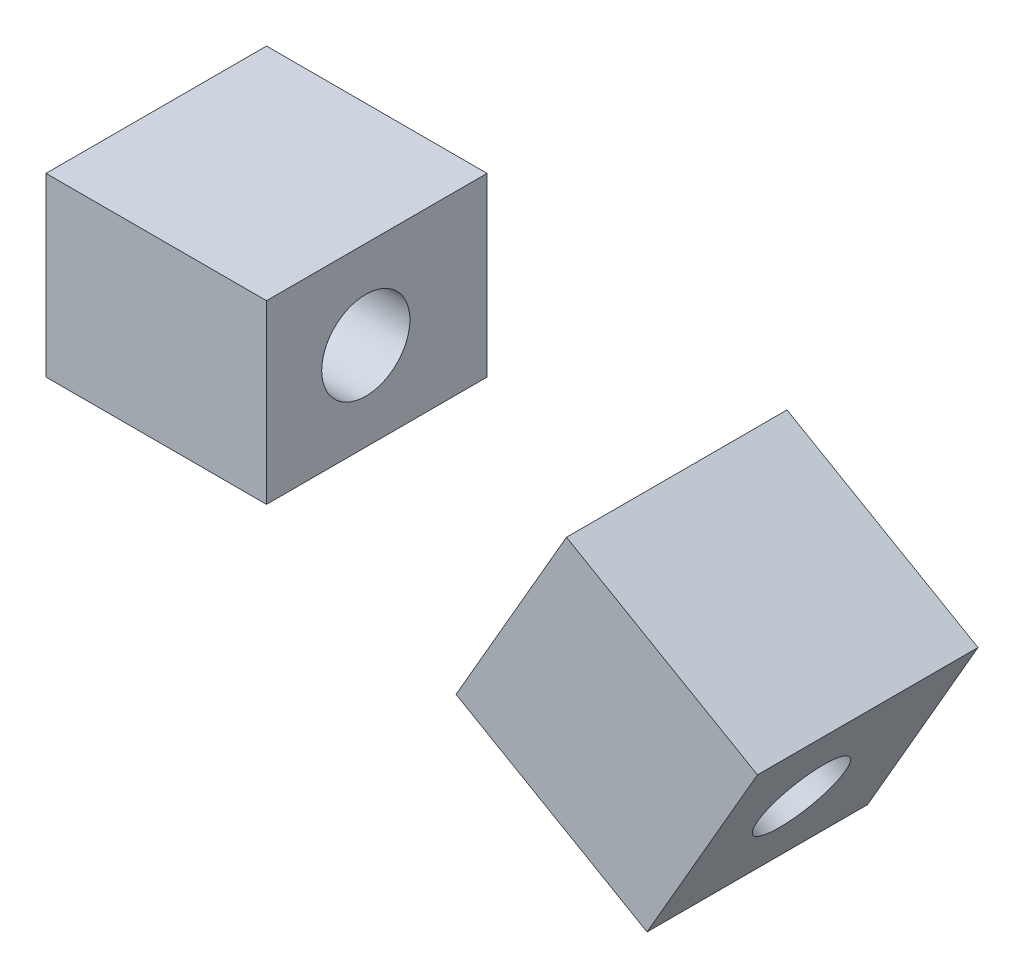
ISO-10303-21;
HEADER;
FILE_DESCRIPTION(('STEP AP214'),'2;1');
FILE_NAME('part.step','',(''),(''),'','','');
FILE_SCHEMA(('AUTOMOTIVE_DESIGN { 1 0 10303 214 1 1 1 1 }'));
ENDSEC;
DATA;
#1=APPLICATION_CONTEXT('core data for automotive mechanical design processes');
#2=APPLICATION_PROTOCOL_DEFINITION('international standard','automotive_design',2000,#1);
#3=PRODUCT_CONTEXT('',#1,'mechanical');
#4=PRODUCT('Part','Part','',(#3));
#5=PRODUCT_RELATED_PRODUCT_CATEGORY('part','',(#4));
#6=PRODUCT_DEFINITION_FORMATION('','',#4);
#7=PRODUCT_DEFINITION_CONTEXT('part definition',#1,'design');
#8=PRODUCT_DEFINITION('design','',#6,#7);
#9=PRODUCT_DEFINITION_SHAPE('','',#8);
#10=(LENGTH_UNIT() NAMED_UNIT(*) SI_UNIT(.MILLI.,.METRE.));
#11=(NAMED_UNIT(*) PLANE_ANGLE_UNIT() SI_UNIT($,.RADIAN.));
#12=(NAMED_UNIT(*) SI_UNIT($,.STERADIAN.) SOLID_ANGLE_UNIT());
#13=UNCERTAINTY_MEASURE_WITH_UNIT(LENGTH_MEASURE(1.E-05),#10,'distance_accuracy_value','');
#14=(GEOMETRIC_REPRESENTATION_CONTEXT(3) GLOBAL_UNCERTAINTY_ASSIGNED_CONTEXT((#13)) GLOBAL_UNIT_ASSIGNED_CONTEXT((#10,
#11,#12)) REPRESENTATION_CONTEXT('',''));
#15=CARTESIAN_POINT('',(0.,0.,0.));
#16=DIRECTION('',(0.,0.,1.));
#17=DIRECTION('',(1.,0.,0.));
#18=AXIS2_PLACEMENT_3D('',#15,#16,#17);
#19=CARTESIAN_POINT('',(-11.8142793956161,-8.00000000000001,20.));
#20=DIRECTION('',(-1.,0.,0.));
#21=DIRECTION('',(0.,0.,1.));
#22=AXIS2_PLACEMENT_3D('',#19,#20,#21);
#23=PLANE('',#22);
#24=CARTESIAN_POINT('',(-11.8142793956161,0.,11.));
#25=DIRECTION('',(-1.,0.,0.));
#26=DIRECTION('',(0.,0.,1.));
#27=AXIS2_PLACEMENT_3D('',#24,#25,#26);
#28=CIRCLE('',#27,4.);
#29=CARTESIAN_POINT('',(-11.8142793956161,0.,15.));
#30=VERTEX_POINT('',#29);
#31=EDGE_CURVE('E221',#30,#30,#28,.T.);
#32=ORIENTED_EDGE('',*,*,#31,.T.);
#33=EDGE_LOOP('',(#32));
#34=FACE_BOUND('',#33,.T.);
#35=DIRECTION('',(0.,1.,0.));
#36=VECTOR('',#35,1.);
#37=CARTESIAN_POINT('',(-11.8142793956161,-8.00000000000001,0.));
#38=LINE('',#37,#36);
#39=CARTESIAN_POINT('',(-11.8142793956161,-8.00000000000001,0.));
#40=VERTEX_POINT('',#39);
#41=CARTESIAN_POINT('',(-11.8142793956161,8.00000000000001,0.));
#42=VERTEX_POINT('',#41);
#43=EDGE_CURVE('E89',#40,#42,#38,.T.);
#44=ORIENTED_EDGE('',*,*,#43,.T.);
#45=DIRECTION('',(0.,0.,-1.));
#46=VECTOR('',#45,1.);
#47=CARTESIAN_POINT('',(-11.8142793956161,8.00000000000001,20.));
#48=LINE('',#47,#46);
#49=CARTESIAN_POINT('',(-11.8142793956161,8.00000000000001,20.));
#50=VERTEX_POINT('',#49);
#51=EDGE_CURVE('E9',#50,#42,#48,.T.);
#52=ORIENTED_EDGE('',*,*,#51,.F.);
#53=DIRECTION('',(0.,1.,0.));
#54=VECTOR('',#53,1.);
#55=CARTESIAN_POINT('',(-11.8142793956161,-8.00000000000001,20.));
#56=LINE('',#55,#54);
#57=CARTESIAN_POINT('',(-11.8142793956161,-8.00000000000001,20.));
#58=VERTEX_POINT('',#57);
#59=EDGE_CURVE('E140',#58,#50,#56,.T.);
#60=ORIENTED_EDGE('',*,*,#59,.F.);
#61=DIRECTION('',(0.,0.,-1.));
#62=VECTOR('',#61,1.);
#63=CARTESIAN_POINT('',(-11.8142793956161,-8.00000000000001,20.));
#64=LINE('',#63,#62);
#65=EDGE_CURVE('E148',#58,#40,#64,.T.);
#66=ORIENTED_EDGE('',*,*,#65,.T.);
#67=EDGE_LOOP('',(#44,#52,#60,#66));
#68=FACE_BOUND('',#67,.T.);
#69=ADVANCED_FACE('F17',(#34,#68),#23,.F.);
#70=CARTESIAN_POINT('',(-11.8142793956161,8.00000000000001,20.));
#71=DIRECTION('',(0.,-1.,0.));
#72=DIRECTION('',(0.,0.,-1.));
#73=AXIS2_PLACEMENT_3D('',#70,#71,#72);
#74=PLANE('',#73);
#75=ORIENTED_EDGE('',*,*,#51,.T.);
#76=DIRECTION('',(-1.,0.,0.));
#77=VECTOR('',#76,1.);
#78=CARTESIAN_POINT('',(-11.8142793956161,8.00000000000001,0.));
#79=LINE('',#78,#77);
#80=CARTESIAN_POINT('',(-31.8142793956161,8.00000000000001,0.));
#81=VERTEX_POINT('',#80);
#82=EDGE_CURVE('E131',#42,#81,#79,.T.);
#83=ORIENTED_EDGE('',*,*,#82,.T.);
#84=DIRECTION('',(0.,0.,-1.));
#85=VECTOR('',#84,1.);
#86=CARTESIAN_POINT('',(-31.8142793956161,8.00000000000001,20.));
#87=LINE('',#86,#85);
#88=CARTESIAN_POINT('',(-31.8142793956161,8.00000000000001,20.));
#89=VERTEX_POINT('',#88);
#90=EDGE_CURVE('E24',#89,#81,#87,.T.);
#91=ORIENTED_EDGE('',*,*,#90,.F.);
#92=DIRECTION('',(-1.,0.,0.));
#93=VECTOR('',#92,1.);
#94=CARTESIAN_POINT('',(-11.8142793956161,8.00000000000001,20.));
#95=LINE('',#94,#93);
#96=EDGE_CURVE('E144',#50,#89,#95,.T.);
#97=ORIENTED_EDGE('',*,*,#96,.F.);
#98=EDGE_LOOP('',(#75,#83,#91,#97));
#99=FACE_BOUND('',#98,.T.);
#100=ADVANCED_FACE('F171',(#99),#74,.F.);
#101=CARTESIAN_POINT('',(-31.8142793956161,8.00000000000001,20.));
#102=DIRECTION('',(1.,0.,0.));
#103=DIRECTION('',(0.,0.,-1.));
#104=AXIS2_PLACEMENT_3D('',#101,#102,#103);
#105=PLANE('',#104);
#106=CARTESIAN_POINT('',(-31.8142793956161,0.,11.));
#107=DIRECTION('',(-1.,0.,0.));
#108=DIRECTION('',(0.,-1.,0.));
#109=AXIS2_PLACEMENT_3D('',#106,#107,#108);
#110=CIRCLE('',#109,4.);
#111=CARTESIAN_POINT('',(-31.8142793956161,-4.,11.));
#112=VERTEX_POINT('',#111);
#113=EDGE_CURVE('E224',#112,#112,#110,.T.);
#114=ORIENTED_EDGE('',*,*,#113,.F.);
#115=EDGE_LOOP('',(#114));
#116=FACE_BOUND('',#115,.T.);
#117=DIRECTION('',(0.,-1.,0.));
#118=VECTOR('',#117,1.);
#119=CARTESIAN_POINT('',(-31.8142793956161,8.00000000000001,0.));
#120=LINE('',#119,#118);
#121=CARTESIAN_POINT('',(-31.8142793956161,-7.99999999999999,0.));
#122=VERTEX_POINT('',#121);
#123=EDGE_CURVE('E134',#81,#122,#120,.T.);
#124=ORIENTED_EDGE('',*,*,#123,.T.);
#125=DIRECTION('',(0.,0.,-1.));
#126=VECTOR('',#125,1.);
#127=CARTESIAN_POINT('',(-31.8142793956161,-7.99999999999999,20.));
#128=LINE('',#127,#126);
#129=CARTESIAN_POINT('',(-31.8142793956161,-7.99999999999999,20.));
#130=VERTEX_POINT('',#129);
#131=EDGE_CURVE('E152',#130,#122,#128,.T.);
#132=ORIENTED_EDGE('',*,*,#131,.F.);
#133=DIRECTION('',(0.,-1.,0.));
#134=VECTOR('',#133,1.);
#135=CARTESIAN_POINT('',(-31.8142793956161,8.00000000000001,20.));
#136=LINE('',#135,#134);
#137=EDGE_CURVE('E36',#89,#130,#136,.T.);
#138=ORIENTED_EDGE('',*,*,#137,.F.);
#139=ORIENTED_EDGE('',*,*,#90,.T.);
#140=EDGE_LOOP('',(#124,#132,#138,#139));
#141=FACE_BOUND('',#140,.T.);
#142=ADVANCED_FACE('F158',(#116,#141),#105,.F.);
#143=CARTESIAN_POINT('',(-11.8142793956161,-8.00000000000001,20.));
#144=DIRECTION('',(0.,1.,0.));
#145=DIRECTION('',(0.,0.,1.));
#146=AXIS2_PLACEMENT_3D('',#143,#144,#145);
#147=PLANE('',#146);
#148=DIRECTION('',(1.,0.,0.));
#149=VECTOR('',#148,1.);
#150=CARTESIAN_POINT('',(-11.8142793956161,-8.00000000000001,0.));
#151=LINE('',#150,#149);
#152=EDGE_CURVE('E137',#122,#40,#151,.T.);
#153=ORIENTED_EDGE('',*,*,#152,.T.);
#154=ORIENTED_EDGE('',*,*,#65,.F.);
#155=DIRECTION('',(1.,0.,0.));
#156=VECTOR('',#155,1.);
#157=CARTESIAN_POINT('',(-11.8142793956161,-8.00000000000001,20.));
#158=LINE('',#157,#156);
#159=EDGE_CURVE('E31',#130,#58,#158,.T.);
#160=ORIENTED_EDGE('',*,*,#159,.F.);
#161=ORIENTED_EDGE('',*,*,#131,.T.);
#162=EDGE_LOOP('',(#153,#154,#160,#161));
#163=FACE_BOUND('',#162,.T.);
#164=ADVANCED_FACE('F166',(#163),#147,.F.);
#165=CARTESIAN_POINT('',(-11.8142793956161,8.00000000000001,20.));
#166=DIRECTION('',(0.,0.,1.));
#167=DIRECTION('',(1.,0.,0.));
#168=AXIS2_PLACEMENT_3D('',#165,#166,#167);
#169=PLANE('',#168);
#170=ORIENTED_EDGE('',*,*,#59,.T.);
#171=ORIENTED_EDGE('',*,*,#96,.T.);
#172=ORIENTED_EDGE('',*,*,#137,.T.);
#173=ORIENTED_EDGE('',*,*,#159,.T.);
#174=EDGE_LOOP('',(#170,#171,#172,#173));
#175=FACE_BOUND('',#174,.T.);
#176=ADVANCED_FACE('F170',(#175),#169,.T.);
#177=CARTESIAN_POINT('',(-11.8142793956161,8.00000000000001,0.));
#178=DIRECTION('',(0.,0.,1.));
#179=DIRECTION('',(1.,0.,0.));
#180=AXIS2_PLACEMENT_3D('',#177,#178,#179);
#181=PLANE('',#180);
#182=ORIENTED_EDGE('',*,*,#43,.F.);
#183=ORIENTED_EDGE('',*,*,#152,.F.);
#184=ORIENTED_EDGE('',*,*,#123,.F.);
#185=ORIENTED_EDGE('',*,*,#82,.F.);
#186=EDGE_LOOP('',(#182,#183,#184,#185));
#187=FACE_BOUND('',#186,.T.);
#188=ADVANCED_FACE('F164',(#187),#181,.F.);
#189=CARTESIAN_POINT('',(43.0715166346412,0.,11.));
#190=DIRECTION('',(-1.,0.,0.));
#191=DIRECTION('',(0.,0.,1.));
#192=AXIS2_PLACEMENT_3D('',#189,#190,#191);
#193=CYLINDRICAL_SURFACE('',#192,4.);
#194=ORIENTED_EDGE('',*,*,#31,.F.);
#195=EDGE_LOOP('',(#194));
#196=FACE_BOUND('',#195,.T.);
#197=ORIENTED_EDGE('',*,*,#113,.T.);
#198=EDGE_LOOP('',(#197));
#199=FACE_BOUND('',#198,.T.);
#200=ADVANCED_FACE('F190',(#196,#199),#193,.F.);
#201=CLOSED_SHELL('',(#69,#100,#142,#164,#176,#188,#200));
#202=MANIFOLD_SOLID_BREP('B1',#201);
#203=CARTESIAN_POINT('',(5.37070182743182,-14.3262303538173,20.));
#204=DIRECTION('',(-0.499999999999999,-0.866025403784439,0.));
#205=DIRECTION('',(0.866025403784439,-0.499999999999999,0.));
#206=AXIS2_PLACEMENT_3D('',#203,#204,#205);
#207=PLANE('',#206);
#208=DIRECTION('',(-0.866025403784439,0.499999999999999,0.));
#209=VECTOR('',#208,1.);
#210=CARTESIAN_POINT('',(5.37070182743182,-14.3262303538173,0.));
#211=LINE('',#210,#209);
#212=CARTESIAN_POINT('',(22.6912099031218,-24.326230353818,0.));
#213=VERTEX_POINT('',#212);
#214=CARTESIAN_POINT('',(5.37070182743182,-14.3262303538173,0.));
#215=VERTEX_POINT('',#214);
#216=EDGE_CURVE('E83',#213,#215,#211,.T.);
#217=ORIENTED_EDGE('',*,*,#216,.F.);
#218=DIRECTION('',(0.,0.,-1.));
#219=VECTOR('',#218,1.);
#220=CARTESIAN_POINT('',(22.6912099031218,-24.326230353818,20.));
#221=LINE('',#220,#219);
#222=CARTESIAN_POINT('',(22.6912099031218,-24.326230353818,20.));
#223=VERTEX_POINT('',#222);
#224=EDGE_CURVE('E125',#223,#213,#221,.T.);
#225=ORIENTED_EDGE('',*,*,#224,.F.);
#226=DIRECTION('',(-0.866025403784439,0.499999999999999,0.));
#227=VECTOR('',#226,1.);
#228=CARTESIAN_POINT('',(5.37070182743182,-14.3262303538173,20.));
#229=LINE('',#228,#227);
#230=CARTESIAN_POINT('',(5.37070182743182,-14.3262303538173,20.));
#231=VERTEX_POINT('',#230);
#232=EDGE_CURVE('E85',#223,#231,#229,.T.);
#233=ORIENTED_EDGE('',*,*,#232,.T.);
#234=DIRECTION('',(0.,0.,-1.));
#235=VECTOR('',#234,1.);
#236=CARTESIAN_POINT('',(5.37070182743182,-14.3262303538173,20.));
#237=LINE('',#236,#235);
#238=EDGE_CURVE('E80',#231,#215,#237,.T.);
#239=ORIENTED_EDGE('',*,*,#238,.T.);
#240=EDGE_LOOP('',(#217,#225,#233,#239));
#241=FACE_BOUND('',#240,.T.);
#242=ADVANCED_FACE('F15',(#241),#207,.T.);
#243=CARTESIAN_POINT('',(5.37070182743182,-14.3262303538173,20.));
#244=DIRECTION('',(-0.866025403784439,0.499999999999999,0.));
#245=DIRECTION('',(-0.499999999999999,-0.866025403784439,0.));
#246=AXIS2_PLACEMENT_3D('',#243,#244,#245);
#247=PLANE('',#246);
#248=CARTESIAN_POINT('',(10.378216314488,-5.65296084259884,11.));
#249=DIRECTION('',(-0.866025403784439,0.499999999999999,0.));
#250=DIRECTION('',(-0.499999999999999,-0.866025403784439,0.));
#251=AXIS2_PLACEMENT_3D('',#248,#249,#250);
#252=CIRCLE('',#251,4.);
#253=CARTESIAN_POINT('',(8.378216314488,-9.11706245773659,11.));
#254=VERTEX_POINT('',#253);
#255=EDGE_CURVE('E106',#254,#254,#252,.T.);
#256=ORIENTED_EDGE('',*,*,#255,.F.);
#257=EDGE_LOOP('',(#256));
#258=FACE_BOUND('',#257,.T.);
#259=DIRECTION('',(0.,0.,-1.));
#260=VECTOR('',#259,1.);
#261=CARTESIAN_POINT('',(15.3857308015442,3.02030866861968,20.));
#262=LINE('',#261,#260);
#263=CARTESIAN_POINT('',(15.3857308015442,3.02030866861968,20.));
#264=VERTEX_POINT('',#263);
#265=CARTESIAN_POINT('',(15.3857308015442,3.02030866861968,0.));
#266=VERTEX_POINT('',#265);
#267=EDGE_CURVE('E90',#264,#266,#262,.T.);
#268=ORIENTED_EDGE('',*,*,#267,.T.);
#269=DIRECTION('',(0.499999999999999,0.866025403784439,0.));
#270=VECTOR('',#269,1.);
#271=CARTESIAN_POINT('',(5.37070182743182,-14.3262303538173,0.));
#272=LINE('',#271,#270);
#273=EDGE_CURVE('E93',#215,#266,#272,.T.);
#274=ORIENTED_EDGE('',*,*,#273,.F.);
#275=ORIENTED_EDGE('',*,*,#238,.F.);
#276=DIRECTION('',(0.499999999999999,0.866025403784439,0.));
#277=VECTOR('',#276,1.);
#278=CARTESIAN_POINT('',(5.37070182743182,-14.3262303538173,20.));
#279=LINE('',#278,#277);
#280=EDGE_CURVE('E117',#231,#264,#279,.T.);
#281=ORIENTED_EDGE('',*,*,#280,.T.);
#282=EDGE_LOOP('',(#268,#274,#275,#281));
#283=FACE_BOUND('',#282,.T.);
#284=ADVANCED_FACE('F94',(#258,#283),#247,.T.);
#285=CARTESIAN_POINT('',(15.3857308015442,3.02030866861968,20.));
#286=DIRECTION('',(0.499999999999999,0.866025403784439,0.));
#287=DIRECTION('',(-0.866025403784439,0.499999999999999,0.));
#288=AXIS2_PLACEMENT_3D('',#285,#286,#287);
#289=PLANE('',#288);
#290=DIRECTION('',(0.866025403784439,-0.499999999999999,0.));
#291=VECTOR('',#290,1.);
#292=CARTESIAN_POINT('',(15.3857308015442,3.02030866861968,0.));
#293=LINE('',#292,#291);
#294=CARTESIAN_POINT('',(32.7062388772341,-6.979691331381,0.));
#295=VERTEX_POINT('',#294);
#296=EDGE_CURVE('E99',#266,#295,#293,.T.);
#297=ORIENTED_EDGE('',*,*,#296,.F.);
#298=ORIENTED_EDGE('',*,*,#267,.F.);
#299=DIRECTION('',(0.866025403784439,-0.499999999999999,0.));
#300=VECTOR('',#299,1.);
#301=CARTESIAN_POINT('',(15.3857308015442,3.02030866861968,20.));
#302=LINE('',#301,#300);
#303=CARTESIAN_POINT('',(32.7062388772341,-6.979691331381,20.));
#304=VERTEX_POINT('',#303);
#305=EDGE_CURVE('E119',#264,#304,#302,.T.);
#306=ORIENTED_EDGE('',*,*,#305,.T.);
#307=DIRECTION('',(0.,0.,-1.));
#308=VECTOR('',#307,1.);
#309=CARTESIAN_POINT('',(32.7062388772341,-6.979691331381,20.));
#310=LINE('',#309,#308);
#311=EDGE_CURVE('E128',#304,#295,#310,.T.);
#312=ORIENTED_EDGE('',*,*,#311,.T.);
#313=EDGE_LOOP('',(#297,#298,#306,#312));
#314=FACE_BOUND('',#313,.T.);
#315=ADVANCED_FACE('F195',(#314),#289,.T.);
#316=CARTESIAN_POINT('',(22.6912099031218,-24.326230353818,20.));
#317=DIRECTION('',(0.866025403784439,-0.499999999999999,0.));
#318=DIRECTION('',(0.499999999999999,0.866025403784439,0.));
#319=AXIS2_PLACEMENT_3D('',#316,#317,#318);
#320=PLANE('',#319);
#321=CARTESIAN_POINT('',(27.698724390178,-15.6529608425995,11.));
#322=DIRECTION('',(0.866025403784439,-0.499999999999999,0.));
#323=DIRECTION('',(0.499999999999999,0.866025403784439,0.));
#324=AXIS2_PLACEMENT_3D('',#321,#322,#323);
#325=CIRCLE('',#324,4.);
#326=CARTESIAN_POINT('',(29.698724390178,-12.1888592274617,11.));
#327=VERTEX_POINT('',#326);
#328=EDGE_CURVE('E112',#327,#327,#325,.T.);
#329=ORIENTED_EDGE('',*,*,#328,.F.);
#330=EDGE_LOOP('',(#329));
#331=FACE_BOUND('',#330,.T.);
#332=DIRECTION('',(-0.499999999999999,-0.866025403784439,0.));
#333=VECTOR('',#332,1.);
#334=CARTESIAN_POINT('',(22.6912099031218,-24.326230353818,0.));
#335=LINE('',#334,#333);
#336=EDGE_CURVE('E104',#295,#213,#335,.T.);
#337=ORIENTED_EDGE('',*,*,#336,.F.);
#338=ORIENTED_EDGE('',*,*,#311,.F.);
#339=DIRECTION('',(-0.499999999999999,-0.866025403784439,0.));
#340=VECTOR('',#339,1.);
#341=CARTESIAN_POINT('',(22.6912099031218,-24.326230353818,20.));
#342=LINE('',#341,#340);
#343=EDGE_CURVE('E122',#304,#223,#342,.T.);
#344=ORIENTED_EDGE('',*,*,#343,.T.);
#345=ORIENTED_EDGE('',*,*,#224,.T.);
#346=EDGE_LOOP('',(#337,#338,#344,#345));
#347=FACE_BOUND('',#346,.T.);
#348=ADVANCED_FACE('F199',(#331,#347),#320,.T.);
#349=CARTESIAN_POINT('',(5.37070182743182,-14.3262303538173,20.));
#350=DIRECTION('',(0.,0.,-1.));
#351=DIRECTION('',(-1.,0.,0.));
#352=AXIS2_PLACEMENT_3D('',#349,#350,#351);
#353=PLANE('',#352);
#354=ORIENTED_EDGE('',*,*,#232,.F.);
#355=ORIENTED_EDGE('',*,*,#343,.F.);
#356=ORIENTED_EDGE('',*,*,#305,.F.);
#357=ORIENTED_EDGE('',*,*,#280,.F.);
#358=EDGE_LOOP('',(#354,#355,#356,#357));
#359=FACE_BOUND('',#358,.T.);
#360=ADVANCED_FACE('F203',(#359),#353,.F.);
#361=CARTESIAN_POINT('',(5.37070182743182,-14.3262303538173,0.));
#362=DIRECTION('',(0.,0.,-1.));
#363=DIRECTION('',(-1.,0.,0.));
#364=AXIS2_PLACEMENT_3D('',#361,#362,#363);
#365=PLANE('',#364);
#366=ORIENTED_EDGE('',*,*,#216,.T.);
#367=ORIENTED_EDGE('',*,*,#273,.T.);
#368=ORIENTED_EDGE('',*,*,#296,.T.);
#369=ORIENTED_EDGE('',*,*,#336,.T.);
#370=EDGE_LOOP('',(#366,#367,#368,#369));
#371=FACE_BOUND('',#370,.T.);
#372=ADVANCED_FACE('F102',(#371),#365,.T.);
#373=CARTESIAN_POINT('',(-37.1542773546448,21.7899371725291,11.));
#374=DIRECTION('',(0.866025403784439,-0.499999999999999,0.));
#375=DIRECTION('',(0.499999999999999,0.866025403784439,0.));
#376=AXIS2_PLACEMENT_3D('',#373,#374,#375);
#377=CYLINDRICAL_SURFACE('',#376,4.);
#378=ORIENTED_EDGE('',*,*,#328,.T.);
#379=EDGE_LOOP('',(#378));
#380=FACE_BOUND('',#379,.T.);
#381=ORIENTED_EDGE('',*,*,#255,.T.);
#382=EDGE_LOOP('',(#381));
#383=FACE_BOUND('',#382,.T.);
#384=ADVANCED_FACE('F210',(#380,#383),#377,.F.);
#385=CLOSED_SHELL('',(#242,#284,#315,#348,#360,#372,#384));
#386=MANIFOLD_SOLID_BREP('B1',#385);
#387=ADVANCED_BREP_SHAPE_REPRESENTATION('',(#18,#202,#386),#14);
#388=SHAPE_DEFINITION_REPRESENTATION(#9,#387);
ENDSEC;
END-ISO-10303-21;
